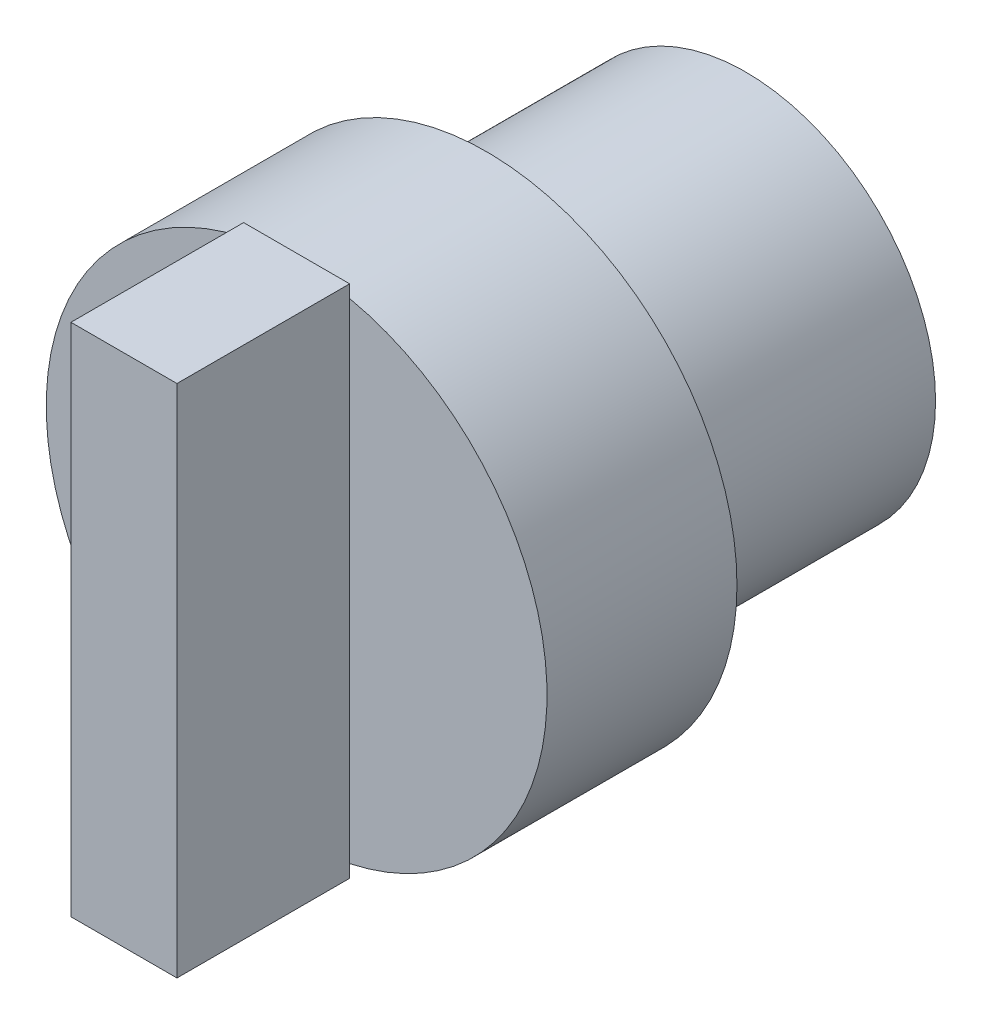
ISO-10303-21;
HEADER;
FILE_DESCRIPTION(('STEP AP214'),'2;1');
FILE_NAME('part.step','',(''),(''),'','','');
FILE_SCHEMA(('AUTOMOTIVE_DESIGN { 1 0 10303 214 1 1 1 1 }'));
ENDSEC;
DATA;
#1=APPLICATION_CONTEXT('core data for automotive mechanical design processes');
#2=APPLICATION_PROTOCOL_DEFINITION('international standard','automotive_design',2000,#1);
#3=PRODUCT_CONTEXT('',#1,'mechanical');
#4=PRODUCT('Part','Part','',(#3));
#5=PRODUCT_RELATED_PRODUCT_CATEGORY('part','',(#4));
#6=PRODUCT_DEFINITION_FORMATION('','',#4);
#7=PRODUCT_DEFINITION_CONTEXT('part definition',#1,'design');
#8=PRODUCT_DEFINITION('design','',#6,#7);
#9=PRODUCT_DEFINITION_SHAPE('','',#8);
#10=(LENGTH_UNIT() NAMED_UNIT(*) SI_UNIT(.MILLI.,.METRE.));
#11=(NAMED_UNIT(*) PLANE_ANGLE_UNIT() SI_UNIT($,.RADIAN.));
#12=(NAMED_UNIT(*) SI_UNIT($,.STERADIAN.) SOLID_ANGLE_UNIT());
#13=UNCERTAINTY_MEASURE_WITH_UNIT(LENGTH_MEASURE(1.E-05),#10,'distance_accuracy_value','');
#14=(GEOMETRIC_REPRESENTATION_CONTEXT(3) GLOBAL_UNCERTAINTY_ASSIGNED_CONTEXT((#13)) GLOBAL_UNIT_ASSIGNED_CONTEXT((#10,
#11,#12)) REPRESENTATION_CONTEXT('',''));
#15=CARTESIAN_POINT('',(0.,0.,0.));
#16=DIRECTION('',(0.,0.,1.));
#17=DIRECTION('',(1.,0.,0.));
#18=AXIS2_PLACEMENT_3D('',#15,#16,#17);
#19=CARTESIAN_POINT('',(0.,0.,26.));
#20=DIRECTION('',(0.,0.,1.));
#21=DIRECTION('',(1.,0.,0.));
#22=AXIS2_PLACEMENT_3D('',#19,#20,#21);
#23=PLANE('',#22);
#24=DIRECTION('',(0.,-1.,0.));
#25=VECTOR('',#24,1.);
#26=CARTESIAN_POINT('',(-3.07016418798867,14.9073196386378,26.));
#27=LINE('',#26,#25);
#28=CARTESIAN_POINT('',(-3.07016418798867,14.1712417190164,26.));
#29=VERTEX_POINT('',#28);
#30=CARTESIAN_POINT('',(-3.07016418798867,-14.1712417190164,26.));
#31=VERTEX_POINT('',#30);
#32=EDGE_CURVE('E11',#29,#31,#27,.T.);
#33=ORIENTED_EDGE('',*,*,#32,.F.);
#34=CARTESIAN_POINT('',(0.,0.,26.));
#35=DIRECTION('',(0.,0.,1.));
#36=DIRECTION('',(1.,0.,0.));
#37=AXIS2_PLACEMENT_3D('',#34,#35,#36);
#38=CIRCLE('',#37,14.5);
#39=EDGE_CURVE('E131',#29,#31,#38,.T.);
#40=ORIENTED_EDGE('',*,*,#39,.T.);
#41=EDGE_LOOP('',(#33,#40));
#42=FACE_BOUND('',#41,.T.);
#43=ADVANCED_FACE('F37',(#42),#23,.T.);
#44=CARTESIAN_POINT('',(0.,0.,15.));
#45=DIRECTION('',(0.,0.,-1.));
#46=DIRECTION('',(-1.,0.,0.));
#47=AXIS2_PLACEMENT_3D('',#44,#45,#46);
#48=CYLINDRICAL_SURFACE('',#47,11.);
#49=CARTESIAN_POINT('',(0.,0.,15.));
#50=DIRECTION('',(0.,0.,1.));
#51=DIRECTION('',(1.,0.,0.));
#52=AXIS2_PLACEMENT_3D('',#49,#50,#51);
#53=CIRCLE('',#52,11.);
#54=CARTESIAN_POINT('',(11.,0.,15.));
#55=VERTEX_POINT('',#54);
#56=EDGE_CURVE('E132',#55,#55,#53,.T.);
#57=ORIENTED_EDGE('',*,*,#56,.F.);
#58=EDGE_LOOP('',(#57));
#59=FACE_BOUND('',#58,.T.);
#60=CARTESIAN_POINT('',(0.,0.,0.));
#61=DIRECTION('',(0.,0.,1.));
#62=DIRECTION('',(1.,0.,0.));
#63=AXIS2_PLACEMENT_3D('',#60,#61,#62);
#64=CIRCLE('',#63,11.);
#65=CARTESIAN_POINT('',(11.,0.,0.));
#66=VERTEX_POINT('',#65);
#67=EDGE_CURVE('E41',#66,#66,#64,.T.);
#68=ORIENTED_EDGE('',*,*,#67,.T.);
#69=EDGE_LOOP('',(#68));
#70=FACE_BOUND('',#69,.T.);
#71=ADVANCED_FACE('F39',(#59,#70),#48,.T.);
#72=CARTESIAN_POINT('',(0.,0.,0.));
#73=DIRECTION('',(0.,0.,1.));
#74=DIRECTION('',(1.,0.,0.));
#75=AXIS2_PLACEMENT_3D('',#72,#73,#74);
#76=PLANE('',#75);
#77=ORIENTED_EDGE('',*,*,#67,.F.);
#78=EDGE_LOOP('',(#77));
#79=FACE_BOUND('',#78,.T.);
#80=ADVANCED_FACE('F143',(#79),#76,.F.);
#81=CARTESIAN_POINT('',(0.,0.,26.));
#82=DIRECTION('',(0.,0.,-1.));
#83=DIRECTION('',(-1.,0.,0.));
#84=AXIS2_PLACEMENT_3D('',#81,#82,#83);
#85=CYLINDRICAL_SURFACE('',#84,14.5);
#86=CARTESIAN_POINT('',(3.07016418798867,14.1712417190164,26.));
#87=VERTEX_POINT('',#86);
#88=EDGE_CURVE('E129',#87,#29,#38,.T.);
#89=ORIENTED_EDGE('',*,*,#88,.F.);
#90=CARTESIAN_POINT('',(3.07016418798867,-14.1712417190164,26.));
#91=VERTEX_POINT('',#90);
#92=EDGE_CURVE('E123',#91,#87,#38,.T.);
#93=ORIENTED_EDGE('',*,*,#92,.F.);
#94=EDGE_CURVE('E61',#31,#91,#38,.T.);
#95=ORIENTED_EDGE('',*,*,#94,.F.);
#96=ORIENTED_EDGE('',*,*,#39,.F.);
#97=EDGE_LOOP('',(#89,#93,#95,#96));
#98=FACE_BOUND('',#97,.T.);
#99=CARTESIAN_POINT('',(0.,0.,15.));
#100=DIRECTION('',(0.,0.,1.));
#101=DIRECTION('',(1.,0.,0.));
#102=AXIS2_PLACEMENT_3D('',#99,#100,#101);
#103=CIRCLE('',#102,14.5);
#104=CARTESIAN_POINT('',(14.5,0.,15.));
#105=VERTEX_POINT('',#104);
#106=EDGE_CURVE('E120',#105,#105,#103,.T.);
#107=ORIENTED_EDGE('',*,*,#106,.T.);
#108=EDGE_LOOP('',(#107));
#109=FACE_BOUND('',#108,.T.);
#110=ADVANCED_FACE('F145',(#98,#109),#85,.T.);
#111=DIRECTION('',(0.,1.,0.));
#112=VECTOR('',#111,1.);
#113=CARTESIAN_POINT('',(3.07016418798867,14.9073196386378,26.));
#114=LINE('',#113,#112);
#115=EDGE_CURVE('E46',#91,#87,#114,.T.);
#116=ORIENTED_EDGE('',*,*,#115,.F.);
#117=ORIENTED_EDGE('',*,*,#92,.T.);
#118=EDGE_LOOP('',(#116,#117));
#119=FACE_BOUND('',#118,.T.);
#120=ADVANCED_FACE('F150',(#119),#23,.T.);
#121=CARTESIAN_POINT('',(0.,0.,15.));
#122=DIRECTION('',(0.,0.,1.));
#123=DIRECTION('',(1.,0.,0.));
#124=AXIS2_PLACEMENT_3D('',#121,#122,#123);
#125=PLANE('',#124);
#126=ORIENTED_EDGE('',*,*,#56,.T.);
#127=EDGE_LOOP('',(#126));
#128=FACE_BOUND('',#127,.T.);
#129=ORIENTED_EDGE('',*,*,#106,.F.);
#130=EDGE_LOOP('',(#129));
#131=FACE_BOUND('',#130,.T.);
#132=ADVANCED_FACE('F161',(#128,#131),#125,.F.);
#133=CARTESIAN_POINT('',(0.,0.,26.));
#134=DIRECTION('',(0.,0.,-1.));
#135=DIRECTION('',(-1.,0.,0.));
#136=AXIS2_PLACEMENT_3D('',#133,#134,#135);
#137=PLANE('',#136);
#138=CARTESIAN_POINT('',(3.07016418798867,14.9073196386378,26.));
#139=VERTEX_POINT('',#138);
#140=EDGE_CURVE('E138',#87,#139,#114,.T.);
#141=ORIENTED_EDGE('',*,*,#140,.F.);
#142=ORIENTED_EDGE('',*,*,#88,.T.);
#143=CARTESIAN_POINT('',(-3.07016418798867,14.9073196386378,26.));
#144=VERTEX_POINT('',#143);
#145=EDGE_CURVE('E48',#144,#29,#27,.T.);
#146=ORIENTED_EDGE('',*,*,#145,.F.);
#147=DIRECTION('',(-1.,0.,0.));
#148=VECTOR('',#147,1.);
#149=CARTESIAN_POINT('',(3.07016418798867,14.9073196386378,26.));
#150=LINE('',#149,#148);
#151=EDGE_CURVE('E114',#139,#144,#150,.T.);
#152=ORIENTED_EDGE('',*,*,#151,.F.);
#153=EDGE_LOOP('',(#141,#142,#146,#152));
#154=FACE_BOUND('',#153,.T.);
#155=ADVANCED_FACE('F165',(#154),#137,.T.);
#156=CARTESIAN_POINT('',(-3.07016418798867,14.9073196386378,36.));
#157=DIRECTION('',(1.,0.,0.));
#158=DIRECTION('',(0.,0.,-1.));
#159=AXIS2_PLACEMENT_3D('',#156,#157,#158);
#160=PLANE('',#159);
#161=ORIENTED_EDGE('',*,*,#145,.T.);
#162=ORIENTED_EDGE('',*,*,#32,.T.);
#163=CARTESIAN_POINT('',(-3.07016418798867,-14.9073196386378,26.));
#164=VERTEX_POINT('',#163);
#165=EDGE_CURVE('E49',#31,#164,#27,.T.);
#166=ORIENTED_EDGE('',*,*,#165,.T.);
#167=DIRECTION('',(0.,0.,-1.));
#168=VECTOR('',#167,1.);
#169=CARTESIAN_POINT('',(-3.07016418798867,-14.9073196386378,36.));
#170=LINE('',#169,#168);
#171=CARTESIAN_POINT('',(-3.07016418798867,-14.9073196386378,36.));
#172=VERTEX_POINT('',#171);
#173=EDGE_CURVE('E99',#172,#164,#170,.T.);
#174=ORIENTED_EDGE('',*,*,#173,.F.);
#175=DIRECTION('',(0.,-1.,0.));
#176=VECTOR('',#175,1.);
#177=CARTESIAN_POINT('',(-3.07016418798867,14.9073196386378,36.));
#178=LINE('',#177,#176);
#179=CARTESIAN_POINT('',(-3.07016418798867,14.9073196386378,36.));
#180=VERTEX_POINT('',#179);
#181=EDGE_CURVE('E105',#180,#172,#178,.T.);
#182=ORIENTED_EDGE('',*,*,#181,.F.);
#183=DIRECTION('',(0.,0.,-1.));
#184=VECTOR('',#183,1.);
#185=CARTESIAN_POINT('',(-3.07016418798867,14.9073196386378,36.));
#186=LINE('',#185,#184);
#187=EDGE_CURVE('E199',#180,#144,#186,.T.);
#188=ORIENTED_EDGE('',*,*,#187,.T.);
#189=EDGE_LOOP('',(#161,#162,#166,#174,#182,#188));
#190=FACE_BOUND('',#189,.T.);
#191=ADVANCED_FACE('F117',(#190),#160,.F.);
#192=CARTESIAN_POINT('',(3.07016418798867,-14.9073196386378,36.));
#193=DIRECTION('',(0.,1.,0.));
#194=DIRECTION('',(0.,0.,1.));
#195=AXIS2_PLACEMENT_3D('',#192,#193,#194);
#196=PLANE('',#195);
#197=DIRECTION('',(1.,0.,0.));
#198=VECTOR('',#197,1.);
#199=CARTESIAN_POINT('',(3.07016418798867,-14.9073196386378,26.));
#200=LINE('',#199,#198);
#201=CARTESIAN_POINT('',(3.07016418798867,-14.9073196386378,26.));
#202=VERTEX_POINT('',#201);
#203=EDGE_CURVE('E189',#164,#202,#200,.T.);
#204=ORIENTED_EDGE('',*,*,#203,.T.);
#205=DIRECTION('',(0.,0.,-1.));
#206=VECTOR('',#205,1.);
#207=CARTESIAN_POINT('',(3.07016418798867,-14.9073196386378,36.));
#208=LINE('',#207,#206);
#209=CARTESIAN_POINT('',(3.07016418798867,-14.9073196386378,36.));
#210=VERTEX_POINT('',#209);
#211=EDGE_CURVE('E101',#210,#202,#208,.T.);
#212=ORIENTED_EDGE('',*,*,#211,.F.);
#213=DIRECTION('',(1.,0.,0.));
#214=VECTOR('',#213,1.);
#215=CARTESIAN_POINT('',(3.07016418798867,-14.9073196386378,36.));
#216=LINE('',#215,#214);
#217=EDGE_CURVE('E95',#172,#210,#216,.T.);
#218=ORIENTED_EDGE('',*,*,#217,.F.);
#219=ORIENTED_EDGE('',*,*,#173,.T.);
#220=EDGE_LOOP('',(#204,#212,#218,#219));
#221=FACE_BOUND('',#220,.T.);
#222=ADVANCED_FACE('F97',(#221),#196,.F.);
#223=CARTESIAN_POINT('',(3.07016418798867,14.9073196386378,36.));
#224=DIRECTION('',(-1.,0.,0.));
#225=DIRECTION('',(0.,0.,1.));
#226=AXIS2_PLACEMENT_3D('',#223,#224,#225);
#227=PLANE('',#226);
#228=EDGE_CURVE('E137',#202,#91,#114,.T.);
#229=ORIENTED_EDGE('',*,*,#228,.T.);
#230=ORIENTED_EDGE('',*,*,#115,.T.);
#231=ORIENTED_EDGE('',*,*,#140,.T.);
#232=DIRECTION('',(0.,0.,-1.));
#233=VECTOR('',#232,1.);
#234=CARTESIAN_POINT('',(3.07016418798867,14.9073196386378,36.));
#235=LINE('',#234,#233);
#236=CARTESIAN_POINT('',(3.07016418798867,14.9073196386378,36.));
#237=VERTEX_POINT('',#236);
#238=EDGE_CURVE('E125',#237,#139,#235,.T.);
#239=ORIENTED_EDGE('',*,*,#238,.F.);
#240=DIRECTION('',(0.,1.,0.));
#241=VECTOR('',#240,1.);
#242=CARTESIAN_POINT('',(3.07016418798867,14.9073196386378,36.));
#243=LINE('',#242,#241);
#244=EDGE_CURVE('E104',#210,#237,#243,.T.);
#245=ORIENTED_EDGE('',*,*,#244,.F.);
#246=ORIENTED_EDGE('',*,*,#211,.T.);
#247=EDGE_LOOP('',(#229,#230,#231,#239,#245,#246));
#248=FACE_BOUND('',#247,.T.);
#249=ADVANCED_FACE('F195',(#248),#227,.F.);
#250=CARTESIAN_POINT('',(3.07016418798867,14.9073196386378,36.));
#251=DIRECTION('',(0.,-1.,0.));
#252=DIRECTION('',(0.,0.,-1.));
#253=AXIS2_PLACEMENT_3D('',#250,#251,#252);
#254=PLANE('',#253);
#255=ORIENTED_EDGE('',*,*,#151,.T.);
#256=ORIENTED_EDGE('',*,*,#187,.F.);
#257=DIRECTION('',(-1.,0.,0.));
#258=VECTOR('',#257,1.);
#259=CARTESIAN_POINT('',(3.07016418798867,14.9073196386378,36.));
#260=LINE('',#259,#258);
#261=EDGE_CURVE('E110',#237,#180,#260,.T.);
#262=ORIENTED_EDGE('',*,*,#261,.F.);
#263=ORIENTED_EDGE('',*,*,#238,.T.);
#264=EDGE_LOOP('',(#255,#256,#262,#263));
#265=FACE_BOUND('',#264,.T.);
#266=ADVANCED_FACE('F186',(#265),#254,.F.);
#267=CARTESIAN_POINT('',(0.,0.,36.));
#268=DIRECTION('',(0.,0.,-1.));
#269=DIRECTION('',(-1.,0.,0.));
#270=AXIS2_PLACEMENT_3D('',#267,#268,#269);
#271=PLANE('',#270);
#272=ORIENTED_EDGE('',*,*,#181,.T.);
#273=ORIENTED_EDGE('',*,*,#217,.T.);
#274=ORIENTED_EDGE('',*,*,#244,.T.);
#275=ORIENTED_EDGE('',*,*,#261,.T.);
#276=EDGE_LOOP('',(#272,#273,#274,#275));
#277=FACE_BOUND('',#276,.T.);
#278=ADVANCED_FACE('F108',(#277),#271,.F.);
#279=ORIENTED_EDGE('',*,*,#165,.F.);
#280=ORIENTED_EDGE('',*,*,#94,.T.);
#281=ORIENTED_EDGE('',*,*,#228,.F.);
#282=ORIENTED_EDGE('',*,*,#203,.F.);
#283=EDGE_LOOP('',(#279,#280,#281,#282));
#284=FACE_BOUND('',#283,.T.);
#285=ADVANCED_FACE('F171',(#284),#137,.T.);
#286=CLOSED_SHELL('',(#43,#71,#80,#110,#120,#132,#155,#191,#222,#249,#266,#278,#285));
#287=MANIFOLD_SOLID_BREP('B2',#286);
#288=ADVANCED_BREP_SHAPE_REPRESENTATION('',(#18,#287),#14);
#289=SHAPE_DEFINITION_REPRESENTATION(#9,#288);
ENDSEC;
END-ISO-10303-21;
